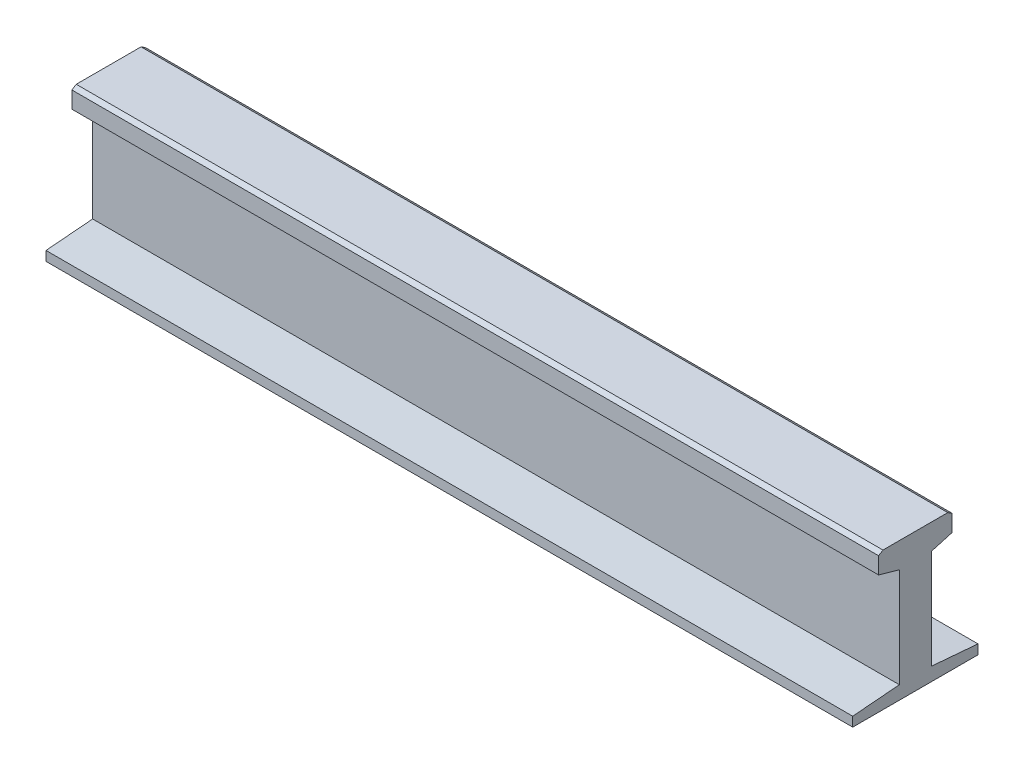
ISO-10303-21;
HEADER;
FILE_DESCRIPTION(('STEP AP214'),'2;1');
FILE_NAME('part.step','',(''),(''),'','','');
FILE_SCHEMA(('AUTOMOTIVE_DESIGN { 1 0 10303 214 1 1 1 1 }'));
ENDSEC;
DATA;
#1=APPLICATION_CONTEXT('core data for automotive mechanical design processes');
#2=APPLICATION_PROTOCOL_DEFINITION('international standard','automotive_design',2000,#1);
#3=PRODUCT_CONTEXT('',#1,'mechanical');
#4=PRODUCT('Part','Part','',(#3));
#5=PRODUCT_RELATED_PRODUCT_CATEGORY('part','',(#4));
#6=PRODUCT_DEFINITION_FORMATION('','',#4);
#7=PRODUCT_DEFINITION_CONTEXT('part definition',#1,'design');
#8=PRODUCT_DEFINITION('design','',#6,#7);
#9=PRODUCT_DEFINITION_SHAPE('','',#8);
#10=(LENGTH_UNIT() NAMED_UNIT(*) SI_UNIT(.MILLI.,.METRE.));
#11=(NAMED_UNIT(*) PLANE_ANGLE_UNIT() SI_UNIT($,.RADIAN.));
#12=(NAMED_UNIT(*) SI_UNIT($,.STERADIAN.) SOLID_ANGLE_UNIT());
#13=UNCERTAINTY_MEASURE_WITH_UNIT(LENGTH_MEASURE(1.E-05),#10,'distance_accuracy_value','');
#14=(GEOMETRIC_REPRESENTATION_CONTEXT(3) GLOBAL_UNCERTAINTY_ASSIGNED_CONTEXT((#13)) GLOBAL_UNIT_ASSIGNED_CONTEXT((#10,
#11,#12)) REPRESENTATION_CONTEXT('',''));
#15=CARTESIAN_POINT('',(0.,0.,0.));
#16=DIRECTION('',(0.,0.,1.));
#17=DIRECTION('',(1.,0.,0.));
#18=AXIS2_PLACEMENT_3D('',#15,#16,#17);
#19=CARTESIAN_POINT('',(850.,0.,-66.));
#20=DIRECTION('',(0.,0.,1.));
#21=DIRECTION('',(1.,0.,0.));
#22=AXIS2_PLACEMENT_3D('',#19,#20,#21);
#23=PLANE('',#22);
#24=DIRECTION('',(0.,1.,0.));
#25=VECTOR('',#24,1.);
#26=CARTESIAN_POINT('',(0.,0.,-66.));
#27=LINE('',#26,#25);
#28=CARTESIAN_POINT('',(0.,0.,-66.));
#29=VERTEX_POINT('',#28);
#30=CARTESIAN_POINT('',(0.,10.,-66.));
#31=VERTEX_POINT('',#30);
#32=EDGE_CURVE('E166',#29,#31,#27,.T.);
#33=ORIENTED_EDGE('',*,*,#32,.T.);
#34=DIRECTION('',(-1.,0.,0.));
#35=VECTOR('',#34,1.);
#36=CARTESIAN_POINT('',(850.,10.,-66.));
#37=LINE('',#36,#35);
#38=CARTESIAN_POINT('',(850.,10.,-66.));
#39=VERTEX_POINT('',#38);
#40=EDGE_CURVE('E11',#39,#31,#37,.T.);
#41=ORIENTED_EDGE('',*,*,#40,.F.);
#42=DIRECTION('',(0.,1.,0.));
#43=VECTOR('',#42,1.);
#44=CARTESIAN_POINT('',(850.,0.,-66.));
#45=LINE('',#44,#43);
#46=CARTESIAN_POINT('',(850.,0.,-66.));
#47=VERTEX_POINT('',#46);
#48=EDGE_CURVE('E192',#47,#39,#45,.T.);
#49=ORIENTED_EDGE('',*,*,#48,.F.);
#50=DIRECTION('',(-1.,0.,0.));
#51=VECTOR('',#50,1.);
#52=CARTESIAN_POINT('',(850.,0.,-66.));
#53=LINE('',#52,#51);
#54=EDGE_CURVE('E162',#47,#29,#53,.T.);
#55=ORIENTED_EDGE('',*,*,#54,.T.);
#56=EDGE_LOOP('',(#33,#41,#49,#55));
#57=FACE_BOUND('',#56,.T.);
#58=ADVANCED_FACE('F34',(#57),#23,.F.);
#59=CARTESIAN_POINT('',(850.,10.,-66.));
#60=DIRECTION('',(0.,-0.996426472799794,0.0844646926458746));
#61=DIRECTION('',(0.,-0.0844646926458746,-0.996426472799794));
#62=AXIS2_PLACEMENT_3D('',#59,#60,#61);
#63=PLANE('',#62);
#64=DIRECTION('',(0.,0.0844646926458746,0.996426472799794));
#65=VECTOR('',#64,1.);
#66=CARTESIAN_POINT('',(0.,10.,-66.));
#67=LINE('',#66,#65);
#68=CARTESIAN_POINT('',(0.,14.1635022351835,-16.8833369690759));
#69=VERTEX_POINT('',#68);
#70=EDGE_CURVE('E169',#31,#69,#67,.T.);
#71=ORIENTED_EDGE('',*,*,#70,.T.);
#72=DIRECTION('',(-1.,0.,0.));
#73=VECTOR('',#72,1.);
#74=CARTESIAN_POINT('',(850.,14.1635022351835,-16.8833369690759));
#75=LINE('',#74,#73);
#76=CARTESIAN_POINT('',(850.,14.1635022351835,-16.8833369690759));
#77=VERTEX_POINT('',#76);
#78=EDGE_CURVE('E42',#77,#69,#75,.T.);
#79=ORIENTED_EDGE('',*,*,#78,.F.);
#80=DIRECTION('',(0.,0.0844646926458746,0.996426472799794));
#81=VECTOR('',#80,1.);
#82=CARTESIAN_POINT('',(850.,10.,-66.));
#83=LINE('',#82,#81);
#84=EDGE_CURVE('E111',#39,#77,#83,.T.);
#85=ORIENTED_EDGE('',*,*,#84,.F.);
#86=ORIENTED_EDGE('',*,*,#40,.T.);
#87=EDGE_LOOP('',(#71,#79,#85,#86));
#88=FACE_BOUND('',#87,.T.);
#89=ADVANCED_FACE('F280',(#88),#63,.F.);
#90=CARTESIAN_POINT('',(850.,14.1635022351835,-16.8833369690759));
#91=DIRECTION('',(0.,0.,1.));
#92=DIRECTION('',(1.,0.,0.));
#93=AXIS2_PLACEMENT_3D('',#90,#91,#92);
#94=PLANE('',#93);
#95=DIRECTION('',(0.,1.,0.));
#96=VECTOR('',#95,1.);
#97=CARTESIAN_POINT('',(0.,14.1635022351835,-16.8833369690759));
#98=LINE('',#97,#96);
#99=CARTESIAN_POINT('',(0.,118.984443330922,-16.8833369690759));
#100=VERTEX_POINT('',#99);
#101=EDGE_CURVE('E171',#69,#100,#98,.T.);
#102=ORIENTED_EDGE('',*,*,#101,.T.);
#103=DIRECTION('',(-1.,0.,0.));
#104=VECTOR('',#103,1.);
#105=CARTESIAN_POINT('',(850.,118.984443330922,-16.8833369690759));
#106=LINE('',#105,#104);
#107=CARTESIAN_POINT('',(850.,118.984443330922,-16.8833369690759));
#108=VERTEX_POINT('',#107);
#109=EDGE_CURVE('E217',#108,#100,#106,.T.);
#110=ORIENTED_EDGE('',*,*,#109,.F.);
#111=DIRECTION('',(0.,1.,0.));
#112=VECTOR('',#111,1.);
#113=CARTESIAN_POINT('',(850.,14.1635022351835,-16.8833369690759));
#114=LINE('',#113,#112);
#115=EDGE_CURVE('E225',#77,#108,#114,.T.);
#116=ORIENTED_EDGE('',*,*,#115,.F.);
#117=ORIENTED_EDGE('',*,*,#78,.T.);
#118=EDGE_LOOP('',(#102,#110,#116,#117));
#119=FACE_BOUND('',#118,.T.);
#120=ADVANCED_FACE('F223',(#119),#94,.F.);
#121=CARTESIAN_POINT('',(850.,118.984443330922,-16.8833369690759));
#122=DIRECTION('',(0.,0.961523947640823,0.274721127897379));
#123=DIRECTION('',(0.,-0.274721127897379,0.961523947640823));
#124=AXIS2_PLACEMENT_3D('',#121,#122,#123);
#125=PLANE('',#124);
#126=DIRECTION('',(0.,0.274721127897379,-0.961523947640823));
#127=VECTOR('',#126,1.);
#128=CARTESIAN_POINT('',(0.,118.984443330922,-16.8833369690759));
#129=LINE('',#128,#127);
#130=CARTESIAN_POINT('',(0.,125.219050303253,-38.7044613722324));
#131=VERTEX_POINT('',#130);
#132=EDGE_CURVE('E173',#100,#131,#129,.T.);
#133=ORIENTED_EDGE('',*,*,#132,.T.);
#134=DIRECTION('',(-1.,0.,0.));
#135=VECTOR('',#134,1.);
#136=CARTESIAN_POINT('',(850.,125.219050303253,-38.7044613722324));
#137=LINE('',#136,#135);
#138=CARTESIAN_POINT('',(850.,125.219050303253,-38.7044613722324));
#139=VERTEX_POINT('',#138);
#140=EDGE_CURVE('E214',#139,#131,#137,.T.);
#141=ORIENTED_EDGE('',*,*,#140,.F.);
#142=DIRECTION('',(0.,0.274721127897379,-0.961523947640823));
#143=VECTOR('',#142,1.);
#144=CARTESIAN_POINT('',(850.,118.984443330922,-16.8833369690759));
#145=LINE('',#144,#143);
#146=EDGE_CURVE('E243',#108,#139,#145,.T.);
#147=ORIENTED_EDGE('',*,*,#146,.F.);
#148=ORIENTED_EDGE('',*,*,#109,.T.);
#149=EDGE_LOOP('',(#133,#141,#147,#148));
#150=FACE_BOUND('',#149,.T.);
#151=ADVANCED_FACE('F234',(#150),#125,.F.);
#152=CARTESIAN_POINT('',(850.,142.782419329308,-38.7044613722324));
#153=DIRECTION('',(0.,0.,1.));
#154=DIRECTION('',(0.,-1.,0.));
#155=AXIS2_PLACEMENT_3D('',#152,#153,#154);
#156=PLANE('',#155);
#157=DIRECTION('',(0.,1.,0.));
#158=VECTOR('',#157,1.);
#159=CARTESIAN_POINT('',(0.,142.782419329308,-38.7044613722324));
#160=LINE('',#159,#158);
#161=CARTESIAN_POINT('',(0.,142.782419329308,-38.7044613722324));
#162=VERTEX_POINT('',#161);
#163=EDGE_CURVE('E175',#131,#162,#160,.T.);
#164=ORIENTED_EDGE('',*,*,#163,.T.);
#165=DIRECTION('',(-1.,0.,0.));
#166=VECTOR('',#165,1.);
#167=CARTESIAN_POINT('',(850.,142.782419329308,-38.7044613722324));
#168=LINE('',#167,#166);
#169=CARTESIAN_POINT('',(850.,142.782419329308,-38.7044613722324));
#170=VERTEX_POINT('',#169);
#171=EDGE_CURVE('E211',#170,#162,#168,.T.);
#172=ORIENTED_EDGE('',*,*,#171,.F.);
#173=DIRECTION('',(0.,1.,0.));
#174=VECTOR('',#173,1.);
#175=CARTESIAN_POINT('',(850.,142.782419329308,-38.7044613722324));
#176=LINE('',#175,#174);
#177=EDGE_CURVE('E240',#139,#170,#176,.T.);
#178=ORIENTED_EDGE('',*,*,#177,.F.);
#179=ORIENTED_EDGE('',*,*,#140,.T.);
#180=EDGE_LOOP('',(#164,#172,#178,#179));
#181=FACE_BOUND('',#180,.T.);
#182=ADVANCED_FACE('F238',(#181),#156,.F.);
#183=CARTESIAN_POINT('',(850.,145.709647500317,-34.1509953284403));
#184=DIRECTION('',(0.,-0.841178475376554,0.540757591313498));
#185=DIRECTION('',(0.,-0.540757591313498,-0.841178475376554));
#186=AXIS2_PLACEMENT_3D('',#183,#184,#185);
#187=PLANE('',#186);
#188=DIRECTION('',(0.,0.540757591313498,0.841178475376554));
#189=VECTOR('',#188,1.);
#190=CARTESIAN_POINT('',(0.,145.709647500317,-34.1509953284403));
#191=LINE('',#190,#189);
#192=CARTESIAN_POINT('',(0.,145.709647500317,-34.1509953284403));
#193=VERTEX_POINT('',#192);
#194=EDGE_CURVE('E177',#162,#193,#191,.T.);
#195=ORIENTED_EDGE('',*,*,#194,.T.);
#196=DIRECTION('',(-1.,0.,0.));
#197=VECTOR('',#196,1.);
#198=CARTESIAN_POINT('',(850.,145.709647500317,-34.1509953284403));
#199=LINE('',#198,#197);
#200=CARTESIAN_POINT('',(850.,145.709647500317,-34.1509953284403));
#201=VERTEX_POINT('',#200);
#202=EDGE_CURVE('E208',#201,#193,#199,.T.);
#203=ORIENTED_EDGE('',*,*,#202,.F.);
#204=DIRECTION('',(0.,0.540757591313498,0.841178475376554));
#205=VECTOR('',#204,1.);
#206=CARTESIAN_POINT('',(850.,145.709647500317,-34.1509953284403));
#207=LINE('',#206,#205);
#208=EDGE_CURVE('E242',#170,#201,#207,.T.);
#209=ORIENTED_EDGE('',*,*,#208,.F.);
#210=ORIENTED_EDGE('',*,*,#171,.T.);
#211=EDGE_LOOP('',(#195,#203,#209,#210));
#212=FACE_BOUND('',#211,.T.);
#213=ADVANCED_FACE('F293',(#212),#187,.F.);
#214=CARTESIAN_POINT('',(850.,145.709647500317,34.1509953284403));
#215=DIRECTION('',(0.,-1.,0.));
#216=DIRECTION('',(0.,0.,-1.));
#217=AXIS2_PLACEMENT_3D('',#214,#215,#216);
#218=PLANE('',#217);
#219=DIRECTION('',(0.,0.,1.));
#220=VECTOR('',#219,1.);
#221=CARTESIAN_POINT('',(0.,145.709647500317,34.1509953284403));
#222=LINE('',#221,#220);
#223=CARTESIAN_POINT('',(0.,145.709647500317,34.1509953284403));
#224=VERTEX_POINT('',#223);
#225=EDGE_CURVE('E179',#193,#224,#222,.T.);
#226=ORIENTED_EDGE('',*,*,#225,.T.);
#227=DIRECTION('',(-1.,0.,0.));
#228=VECTOR('',#227,1.);
#229=CARTESIAN_POINT('',(850.,145.709647500317,34.1509953284403));
#230=LINE('',#229,#228);
#231=CARTESIAN_POINT('',(850.,145.709647500317,34.1509953284403));
#232=VERTEX_POINT('',#231);
#233=EDGE_CURVE('E205',#232,#224,#230,.T.);
#234=ORIENTED_EDGE('',*,*,#233,.F.);
#235=DIRECTION('',(0.,0.,1.));
#236=VECTOR('',#235,1.);
#237=CARTESIAN_POINT('',(850.,145.709647500317,34.1509953284403));
#238=LINE('',#237,#236);
#239=EDGE_CURVE('E245',#201,#232,#238,.T.);
#240=ORIENTED_EDGE('',*,*,#239,.F.);
#241=ORIENTED_EDGE('',*,*,#202,.T.);
#242=EDGE_LOOP('',(#226,#234,#240,#241));
#243=FACE_BOUND('',#242,.T.);
#244=ADVANCED_FACE('F296',(#243),#218,.F.);
#245=CARTESIAN_POINT('',(850.,145.709647500317,34.1509953284403));
#246=DIRECTION('',(0.,-0.841178475376554,-0.540757591313498));
#247=DIRECTION('',(0.,0.540757591313498,-0.841178475376554));
#248=AXIS2_PLACEMENT_3D('',#245,#246,#247);
#249=PLANE('',#248);
#250=DIRECTION('',(0.,-0.540757591313498,0.841178475376554));
#251=VECTOR('',#250,1.);
#252=CARTESIAN_POINT('',(0.,145.709647500317,34.1509953284403));
#253=LINE('',#252,#251);
#254=CARTESIAN_POINT('',(0.,142.782419329308,38.7044613722324));
#255=VERTEX_POINT('',#254);
#256=EDGE_CURVE('E181',#224,#255,#253,.T.);
#257=ORIENTED_EDGE('',*,*,#256,.T.);
#258=DIRECTION('',(-1.,0.,0.));
#259=VECTOR('',#258,1.);
#260=CARTESIAN_POINT('',(850.,142.782419329308,38.7044613722324));
#261=LINE('',#260,#259);
#262=CARTESIAN_POINT('',(850.,142.782419329308,38.7044613722324));
#263=VERTEX_POINT('',#262);
#264=EDGE_CURVE('E202',#263,#255,#261,.T.);
#265=ORIENTED_EDGE('',*,*,#264,.F.);
#266=DIRECTION('',(0.,-0.540757591313498,0.841178475376554));
#267=VECTOR('',#266,1.);
#268=CARTESIAN_POINT('',(850.,145.709647500317,34.1509953284403));
#269=LINE('',#268,#267);
#270=EDGE_CURVE('E251',#232,#263,#269,.T.);
#271=ORIENTED_EDGE('',*,*,#270,.F.);
#272=ORIENTED_EDGE('',*,*,#233,.T.);
#273=EDGE_LOOP('',(#257,#265,#271,#272));
#274=FACE_BOUND('',#273,.T.);
#275=ADVANCED_FACE('F300',(#274),#249,.F.);
#276=CARTESIAN_POINT('',(850.,142.782419329308,38.7044613722324));
#277=DIRECTION('',(0.,0.,-1.));
#278=DIRECTION('',(0.,1.,0.));
#279=AXIS2_PLACEMENT_3D('',#276,#277,#278);
#280=PLANE('',#279);
#281=DIRECTION('',(0.,-1.,0.));
#282=VECTOR('',#281,1.);
#283=CARTESIAN_POINT('',(0.,142.782419329308,38.7044613722324));
#284=LINE('',#283,#282);
#285=CARTESIAN_POINT('',(0.,125.219050303253,38.7044613722324));
#286=VERTEX_POINT('',#285);
#287=EDGE_CURVE('E183',#255,#286,#284,.T.);
#288=ORIENTED_EDGE('',*,*,#287,.T.);
#289=DIRECTION('',(-1.,0.,0.));
#290=VECTOR('',#289,1.);
#291=CARTESIAN_POINT('',(850.,125.219050303253,38.7044613722324));
#292=LINE('',#291,#290);
#293=CARTESIAN_POINT('',(850.,125.219050303253,38.7044613722324));
#294=VERTEX_POINT('',#293);
#295=EDGE_CURVE('E199',#294,#286,#292,.T.);
#296=ORIENTED_EDGE('',*,*,#295,.F.);
#297=DIRECTION('',(0.,-1.,0.));
#298=VECTOR('',#297,1.);
#299=CARTESIAN_POINT('',(850.,142.782419329308,38.7044613722324));
#300=LINE('',#299,#298);
#301=EDGE_CURVE('E253',#263,#294,#300,.T.);
#302=ORIENTED_EDGE('',*,*,#301,.F.);
#303=ORIENTED_EDGE('',*,*,#264,.T.);
#304=EDGE_LOOP('',(#288,#296,#302,#303));
#305=FACE_BOUND('',#304,.T.);
#306=ADVANCED_FACE('F304',(#305),#280,.F.);
#307=CARTESIAN_POINT('',(850.,118.984443330922,16.8833369690759));
#308=DIRECTION('',(0.,0.961523947640823,-0.274721127897379));
#309=DIRECTION('',(0.,0.274721127897379,0.961523947640823));
#310=AXIS2_PLACEMENT_3D('',#307,#308,#309);
#311=PLANE('',#310);
#312=DIRECTION('',(0.,-0.274721127897379,-0.961523947640823));
#313=VECTOR('',#312,1.);
#314=CARTESIAN_POINT('',(0.,118.984443330922,16.8833369690759));
#315=LINE('',#314,#313);
#316=CARTESIAN_POINT('',(0.,118.984443330922,16.8833369690759));
#317=VERTEX_POINT('',#316);
#318=EDGE_CURVE('E185',#286,#317,#315,.T.);
#319=ORIENTED_EDGE('',*,*,#318,.T.);
#320=DIRECTION('',(-1.,0.,0.));
#321=VECTOR('',#320,1.);
#322=CARTESIAN_POINT('',(850.,118.984443330922,16.8833369690759));
#323=LINE('',#322,#321);
#324=CARTESIAN_POINT('',(850.,118.984443330922,16.8833369690759));
#325=VERTEX_POINT('',#324);
#326=EDGE_CURVE('E196',#325,#317,#323,.T.);
#327=ORIENTED_EDGE('',*,*,#326,.F.);
#328=DIRECTION('',(0.,-0.274721127897379,-0.961523947640823));
#329=VECTOR('',#328,1.);
#330=CARTESIAN_POINT('',(850.,118.984443330922,16.8833369690759));
#331=LINE('',#330,#329);
#332=EDGE_CURVE('E255',#294,#325,#331,.T.);
#333=ORIENTED_EDGE('',*,*,#332,.F.);
#334=ORIENTED_EDGE('',*,*,#295,.T.);
#335=EDGE_LOOP('',(#319,#327,#333,#334));
#336=FACE_BOUND('',#335,.T.);
#337=ADVANCED_FACE('F261',(#336),#311,.F.);
#338=CARTESIAN_POINT('',(850.,14.1635022351835,16.8833369690758));
#339=DIRECTION('',(0.,0.,-1.));
#340=DIRECTION('',(0.,1.,0.));
#341=AXIS2_PLACEMENT_3D('',#338,#339,#340);
#342=PLANE('',#341);
#343=DIRECTION('',(0.,-1.,0.));
#344=VECTOR('',#343,1.);
#345=CARTESIAN_POINT('',(0.,14.1635022351835,16.8833369690758));
#346=LINE('',#345,#344);
#347=CARTESIAN_POINT('',(0.,14.1635022351835,16.8833369690758));
#348=VERTEX_POINT('',#347);
#349=EDGE_CURVE('E187',#317,#348,#346,.T.);
#350=ORIENTED_EDGE('',*,*,#349,.T.);
#351=DIRECTION('',(-1.,0.,0.));
#352=VECTOR('',#351,1.);
#353=CARTESIAN_POINT('',(850.,14.1635022351835,16.8833369690758));
#354=LINE('',#353,#352);
#355=CARTESIAN_POINT('',(850.,14.1635022351835,16.8833369690758));
#356=VERTEX_POINT('',#355);
#357=EDGE_CURVE('E157',#356,#348,#354,.T.);
#358=ORIENTED_EDGE('',*,*,#357,.F.);
#359=DIRECTION('',(0.,-1.,0.));
#360=VECTOR('',#359,1.);
#361=CARTESIAN_POINT('',(850.,14.1635022351835,16.8833369690758));
#362=LINE('',#361,#360);
#363=EDGE_CURVE('E148',#325,#356,#362,.T.);
#364=ORIENTED_EDGE('',*,*,#363,.F.);
#365=ORIENTED_EDGE('',*,*,#326,.T.);
#366=EDGE_LOOP('',(#350,#358,#364,#365));
#367=FACE_BOUND('',#366,.T.);
#368=ADVANCED_FACE('F265',(#367),#342,.F.);
#369=CARTESIAN_POINT('',(850.,9.99999999999998,66.));
#370=DIRECTION('',(0.,-0.996426472799794,-0.0844646926458748));
#371=DIRECTION('',(0.,0.0844646926458748,-0.996426472799794));
#372=AXIS2_PLACEMENT_3D('',#369,#370,#371);
#373=PLANE('',#372);
#374=DIRECTION('',(0.,-0.0844646926458748,0.996426472799794));
#375=VECTOR('',#374,1.);
#376=CARTESIAN_POINT('',(0.,9.99999999999998,66.));
#377=LINE('',#376,#375);
#378=CARTESIAN_POINT('',(0.,9.99999999999998,66.));
#379=VERTEX_POINT('',#378);
#380=EDGE_CURVE('E156',#348,#379,#377,.T.);
#381=ORIENTED_EDGE('',*,*,#380,.T.);
#382=DIRECTION('',(-1.,0.,0.));
#383=VECTOR('',#382,1.);
#384=CARTESIAN_POINT('',(850.,9.99999999999998,66.));
#385=LINE('',#384,#383);
#386=CARTESIAN_POINT('',(850.,9.99999999999998,66.));
#387=VERTEX_POINT('',#386);
#388=EDGE_CURVE('E153',#387,#379,#385,.T.);
#389=ORIENTED_EDGE('',*,*,#388,.F.);
#390=DIRECTION('',(0.,-0.0844646926458748,0.996426472799794));
#391=VECTOR('',#390,1.);
#392=CARTESIAN_POINT('',(850.,9.99999999999998,66.));
#393=LINE('',#392,#391);
#394=EDGE_CURVE('E142',#356,#387,#393,.T.);
#395=ORIENTED_EDGE('',*,*,#394,.F.);
#396=ORIENTED_EDGE('',*,*,#357,.T.);
#397=EDGE_LOOP('',(#381,#389,#395,#396));
#398=FACE_BOUND('',#397,.T.);
#399=ADVANCED_FACE('F154',(#398),#373,.F.);
#400=CARTESIAN_POINT('',(850.,1.11022302462516E-13,66.));
#401=DIRECTION('',(0.,0.,-1.));
#402=DIRECTION('',(0.,1.,0.));
#403=AXIS2_PLACEMENT_3D('',#400,#401,#402);
#404=PLANE('',#403);
#405=DIRECTION('',(0.,-1.,0.));
#406=VECTOR('',#405,1.);
#407=CARTESIAN_POINT('',(0.,1.11022302462516E-13,66.));
#408=LINE('',#407,#406);
#409=CARTESIAN_POINT('',(0.,1.11022302462516E-13,66.));
#410=VERTEX_POINT('',#409);
#411=EDGE_CURVE('E97',#379,#410,#408,.T.);
#412=ORIENTED_EDGE('',*,*,#411,.T.);
#413=DIRECTION('',(-1.,0.,0.));
#414=VECTOR('',#413,1.);
#415=CARTESIAN_POINT('',(850.,1.11022302462516E-13,66.));
#416=LINE('',#415,#414);
#417=CARTESIAN_POINT('',(850.,1.11022302462516E-13,66.));
#418=VERTEX_POINT('',#417);
#419=EDGE_CURVE('E158',#418,#410,#416,.T.);
#420=ORIENTED_EDGE('',*,*,#419,.F.);
#421=DIRECTION('',(0.,-1.,0.));
#422=VECTOR('',#421,1.);
#423=CARTESIAN_POINT('',(850.,1.11022302462516E-13,66.));
#424=LINE('',#423,#422);
#425=EDGE_CURVE('E146',#387,#418,#424,.T.);
#426=ORIENTED_EDGE('',*,*,#425,.F.);
#427=ORIENTED_EDGE('',*,*,#388,.T.);
#428=EDGE_LOOP('',(#412,#420,#426,#427));
#429=FACE_BOUND('',#428,.T.);
#430=ADVANCED_FACE('F160',(#429),#404,.F.);
#431=CARTESIAN_POINT('',(850.,1.11022302462516E-13,66.));
#432=DIRECTION('',(0.,1.,0.));
#433=DIRECTION('',(0.,0.,1.));
#434=AXIS2_PLACEMENT_3D('',#431,#432,#433);
#435=PLANE('',#434);
#436=DIRECTION('',(0.,0.,-1.));
#437=VECTOR('',#436,1.);
#438=CARTESIAN_POINT('',(0.,1.11022302462516E-13,66.));
#439=LINE('',#438,#437);
#440=EDGE_CURVE('E103',#410,#29,#439,.T.);
#441=ORIENTED_EDGE('',*,*,#440,.T.);
#442=ORIENTED_EDGE('',*,*,#54,.F.);
#443=DIRECTION('',(0.,0.,-1.));
#444=VECTOR('',#443,1.);
#445=CARTESIAN_POINT('',(850.,1.11022302462516E-13,66.));
#446=LINE('',#445,#444);
#447=EDGE_CURVE('E50',#418,#47,#446,.T.);
#448=ORIENTED_EDGE('',*,*,#447,.F.);
#449=ORIENTED_EDGE('',*,*,#419,.T.);
#450=EDGE_LOOP('',(#441,#442,#448,#449));
#451=FACE_BOUND('',#450,.T.);
#452=ADVANCED_FACE('F269',(#451),#435,.F.);
#453=CARTESIAN_POINT('',(850.,0.,0.));
#454=DIRECTION('',(-1.,0.,0.));
#455=DIRECTION('',(0.,0.,1.));
#456=AXIS2_PLACEMENT_3D('',#453,#454,#455);
#457=PLANE('',#456);
#458=ORIENTED_EDGE('',*,*,#48,.T.);
#459=ORIENTED_EDGE('',*,*,#84,.T.);
#460=ORIENTED_EDGE('',*,*,#115,.T.);
#461=ORIENTED_EDGE('',*,*,#146,.T.);
#462=ORIENTED_EDGE('',*,*,#177,.T.);
#463=ORIENTED_EDGE('',*,*,#208,.T.);
#464=ORIENTED_EDGE('',*,*,#239,.T.);
#465=ORIENTED_EDGE('',*,*,#270,.T.);
#466=ORIENTED_EDGE('',*,*,#301,.T.);
#467=ORIENTED_EDGE('',*,*,#332,.T.);
#468=ORIENTED_EDGE('',*,*,#363,.T.);
#469=ORIENTED_EDGE('',*,*,#394,.T.);
#470=ORIENTED_EDGE('',*,*,#425,.T.);
#471=ORIENTED_EDGE('',*,*,#447,.T.);
#472=EDGE_LOOP('',(#458,#459,#460,#461,#462,#463,#464,#465,#466,#467,#468,#469,#470,#471));
#473=FACE_BOUND('',#472,.T.);
#474=ADVANCED_FACE('F144',(#473),#457,.F.);
#475=CARTESIAN_POINT('',(0.,0.,0.));
#476=DIRECTION('',(-1.,0.,0.));
#477=DIRECTION('',(0.,0.,1.));
#478=AXIS2_PLACEMENT_3D('',#475,#476,#477);
#479=PLANE('',#478);
#480=ORIENTED_EDGE('',*,*,#32,.F.);
#481=ORIENTED_EDGE('',*,*,#440,.F.);
#482=ORIENTED_EDGE('',*,*,#411,.F.);
#483=ORIENTED_EDGE('',*,*,#380,.F.);
#484=ORIENTED_EDGE('',*,*,#349,.F.);
#485=ORIENTED_EDGE('',*,*,#318,.F.);
#486=ORIENTED_EDGE('',*,*,#287,.F.);
#487=ORIENTED_EDGE('',*,*,#256,.F.);
#488=ORIENTED_EDGE('',*,*,#225,.F.);
#489=ORIENTED_EDGE('',*,*,#194,.F.);
#490=ORIENTED_EDGE('',*,*,#163,.F.);
#491=ORIENTED_EDGE('',*,*,#132,.F.);
#492=ORIENTED_EDGE('',*,*,#101,.F.);
#493=ORIENTED_EDGE('',*,*,#70,.F.);
#494=EDGE_LOOP('',(#480,#481,#482,#483,#484,#485,#486,#487,#488,#489,#490,#491,#492,#493));
#495=FACE_BOUND('',#494,.T.);
#496=ADVANCED_FACE('F229',(#495),#479,.T.);
#497=CLOSED_SHELL('',(#58,#89,#120,#151,#182,#213,#244,#275,#306,#337,#368,#399,#430,#452,#474,#496));
#498=MANIFOLD_SOLID_BREP('B2',#497);
#499=ADVANCED_BREP_SHAPE_REPRESENTATION('',(#18,#498),#14);
#500=SHAPE_DEFINITION_REPRESENTATION(#9,#499);
ENDSEC;
END-ISO-10303-21;
